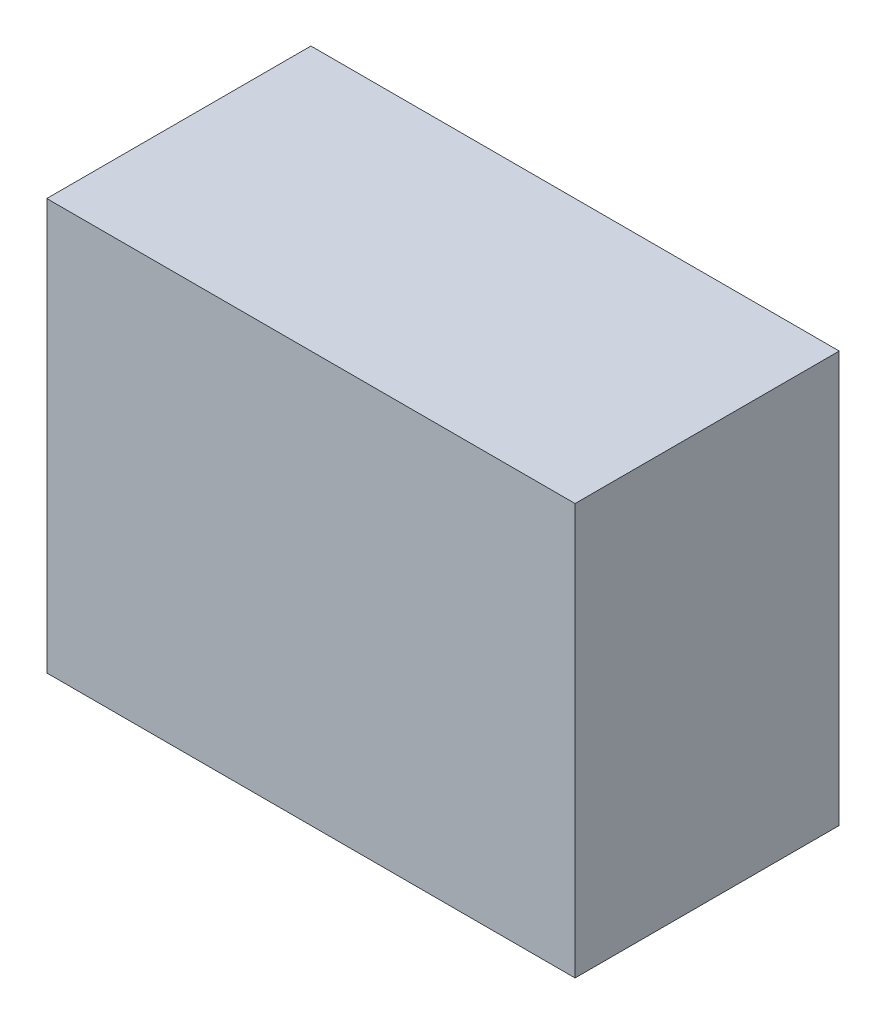
ISO-10303-21;
HEADER;
FILE_DESCRIPTION(('STEP AP214'),'2;1');
FILE_NAME('part.step','',(''),(''),'','','');
FILE_SCHEMA(('AUTOMOTIVE_DESIGN { 1 0 10303 214 1 1 1 1 }'));
ENDSEC;
DATA;
#1=APPLICATION_CONTEXT('core data for automotive mechanical design processes');
#2=APPLICATION_PROTOCOL_DEFINITION('international standard','automotive_design',2000,#1);
#3=PRODUCT_CONTEXT('',#1,'mechanical');
#4=PRODUCT('Part','Part','',(#3));
#5=PRODUCT_RELATED_PRODUCT_CATEGORY('part','',(#4));
#6=PRODUCT_DEFINITION_FORMATION('','',#4);
#7=PRODUCT_DEFINITION_CONTEXT('part definition',#1,'design');
#8=PRODUCT_DEFINITION('design','',#6,#7);
#9=PRODUCT_DEFINITION_SHAPE('','',#8);
#10=(LENGTH_UNIT() NAMED_UNIT(*) SI_UNIT(.MILLI.,.METRE.));
#11=(NAMED_UNIT(*) PLANE_ANGLE_UNIT() SI_UNIT($,.RADIAN.));
#12=(NAMED_UNIT(*) SI_UNIT($,.STERADIAN.) SOLID_ANGLE_UNIT());
#13=UNCERTAINTY_MEASURE_WITH_UNIT(LENGTH_MEASURE(1.E-05),#10,'distance_accuracy_value','');
#14=(GEOMETRIC_REPRESENTATION_CONTEXT(3) GLOBAL_UNCERTAINTY_ASSIGNED_CONTEXT((#13)) GLOBAL_UNIT_ASSIGNED_CONTEXT((#10,
#11,#12)) REPRESENTATION_CONTEXT('',''));
#15=CARTESIAN_POINT('',(0.,0.,0.));
#16=DIRECTION('',(0.,0.,1.));
#17=DIRECTION('',(1.,0.,0.));
#18=AXIS2_PLACEMENT_3D('',#15,#16,#17);
#19=CARTESIAN_POINT('',(1.80000148,1.39999974,1.79999894));
#20=DIRECTION('',(0.,0.,1.));
#21=DIRECTION('',(1.,0.,0.));
#22=AXIS2_PLACEMENT_3D('',#19,#20,#21);
#23=PLANE('',#22);
#24=DIRECTION('',(1.,0.,0.));
#25=VECTOR('',#24,1.);
#26=CARTESIAN_POINT('',(1.80000148,-1.39999974,1.79999894));
#27=LINE('',#26,#25);
#28=CARTESIAN_POINT('',(1.80000148,-1.39999974,1.79999894));
#29=VERTEX_POINT('',#28);
#30=CARTESIAN_POINT('',(-1.79999894,-1.39999974,1.79999894));
#31=VERTEX_POINT('',#30);
#32=EDGE_CURVE('E53',#29,#31,#27,.F.);
#33=ORIENTED_EDGE('',*,*,#32,.F.);
#34=DIRECTION('',(0.,1.,0.));
#35=VECTOR('',#34,1.);
#36=CARTESIAN_POINT('',(1.80000148,1.39999974,1.79999894));
#37=LINE('',#36,#35);
#38=CARTESIAN_POINT('',(1.80000148,1.39999974,1.79999894));
#39=VERTEX_POINT('',#38);
#40=EDGE_CURVE('E68',#39,#29,#37,.F.);
#41=ORIENTED_EDGE('',*,*,#40,.F.);
#42=DIRECTION('',(1.,0.,0.));
#43=VECTOR('',#42,1.);
#44=CARTESIAN_POINT('',(-1.79999894,1.39999974,1.79999894));
#45=LINE('',#44,#43);
#46=CARTESIAN_POINT('',(-1.79999894,1.39999974,1.79999894));
#47=VERTEX_POINT('',#46);
#48=EDGE_CURVE('E20',#47,#39,#45,.T.);
#49=ORIENTED_EDGE('',*,*,#48,.F.);
#50=DIRECTION('',(0.,1.,0.));
#51=VECTOR('',#50,1.);
#52=CARTESIAN_POINT('',(-1.79999894,-1.39999974,1.79999894));
#53=LINE('',#52,#51);
#54=EDGE_CURVE('E58',#31,#47,#53,.T.);
#55=ORIENTED_EDGE('',*,*,#54,.F.);
#56=EDGE_LOOP('',(#33,#41,#49,#55));
#57=FACE_BOUND('',#56,.T.);
#58=ADVANCED_FACE('F17',(#57),#23,.T.);
#59=CARTESIAN_POINT('',(-1.79999894,1.39999974,0.));
#60=DIRECTION('',(0.,1.,0.));
#61=DIRECTION('',(0.,0.,1.));
#62=AXIS2_PLACEMENT_3D('',#59,#60,#61);
#63=PLANE('',#62);
#64=DIRECTION('',(0.,0.,-1.));
#65=VECTOR('',#64,1.);
#66=CARTESIAN_POINT('',(1.80000148,1.39999974,0.));
#67=LINE('',#66,#65);
#68=CARTESIAN_POINT('',(1.80000148,1.39999974,0.));
#69=VERTEX_POINT('',#68);
#70=EDGE_CURVE('E79',#69,#39,#67,.F.);
#71=ORIENTED_EDGE('',*,*,#70,.F.);
#72=DIRECTION('',(1.,0.,0.));
#73=VECTOR('',#72,1.);
#74=CARTESIAN_POINT('',(1.80000148,1.39999974,0.));
#75=LINE('',#74,#73);
#76=CARTESIAN_POINT('',(-1.79999894,1.39999974,0.));
#77=VERTEX_POINT('',#76);
#78=EDGE_CURVE('E74',#69,#77,#75,.F.);
#79=ORIENTED_EDGE('',*,*,#78,.T.);
#80=DIRECTION('',(0.,0.,1.));
#81=VECTOR('',#80,1.);
#82=CARTESIAN_POINT('',(-1.79999894,1.39999974,0.));
#83=LINE('',#82,#81);
#84=EDGE_CURVE('E63',#47,#77,#83,.F.);
#85=ORIENTED_EDGE('',*,*,#84,.F.);
#86=ORIENTED_EDGE('',*,*,#48,.T.);
#87=EDGE_LOOP('',(#71,#79,#85,#86));
#88=FACE_BOUND('',#87,.T.);
#89=ADVANCED_FACE('F73',(#88),#63,.T.);
#90=CARTESIAN_POINT('',(-1.79999894,-1.39999974,0.));
#91=DIRECTION('',(-1.,0.,0.));
#92=DIRECTION('',(0.,0.,1.));
#93=AXIS2_PLACEMENT_3D('',#90,#91,#92);
#94=PLANE('',#93);
#95=ORIENTED_EDGE('',*,*,#84,.T.);
#96=DIRECTION('',(0.,1.,0.));
#97=VECTOR('',#96,1.);
#98=CARTESIAN_POINT('',(-1.79999894,1.39999974,0.));
#99=LINE('',#98,#97);
#100=CARTESIAN_POINT('',(-1.79999894,-1.39999974,0.));
#101=VERTEX_POINT('',#100);
#102=EDGE_CURVE('E84',#77,#101,#99,.F.);
#103=ORIENTED_EDGE('',*,*,#102,.T.);
#104=DIRECTION('',(0.,0.,-1.));
#105=VECTOR('',#104,1.);
#106=CARTESIAN_POINT('',(-1.79999894,-1.39999974,0.));
#107=LINE('',#106,#105);
#108=EDGE_CURVE('E65',#31,#101,#107,.T.);
#109=ORIENTED_EDGE('',*,*,#108,.F.);
#110=ORIENTED_EDGE('',*,*,#54,.T.);
#111=EDGE_LOOP('',(#95,#103,#109,#110));
#112=FACE_BOUND('',#111,.T.);
#113=ADVANCED_FACE('F60',(#112),#94,.T.);
#114=CARTESIAN_POINT('',(1.80000148,-1.39999974,0.));
#115=DIRECTION('',(0.,-1.,0.));
#116=DIRECTION('',(0.,0.,-1.));
#117=AXIS2_PLACEMENT_3D('',#114,#115,#116);
#118=PLANE('',#117);
#119=ORIENTED_EDGE('',*,*,#108,.T.);
#120=DIRECTION('',(1.,0.,0.));
#121=VECTOR('',#120,1.);
#122=CARTESIAN_POINT('',(1.80000148,-1.39999974,0.));
#123=LINE('',#122,#121);
#124=CARTESIAN_POINT('',(1.80000148,-1.39999974,0.));
#125=VERTEX_POINT('',#124);
#126=EDGE_CURVE('E26',#101,#125,#123,.T.);
#127=ORIENTED_EDGE('',*,*,#126,.T.);
#128=DIRECTION('',(0.,0.,-1.));
#129=VECTOR('',#128,1.);
#130=CARTESIAN_POINT('',(1.80000148,-1.39999974,0.));
#131=LINE('',#130,#129);
#132=EDGE_CURVE('E34',#29,#125,#131,.T.);
#133=ORIENTED_EDGE('',*,*,#132,.F.);
#134=ORIENTED_EDGE('',*,*,#32,.T.);
#135=EDGE_LOOP('',(#119,#127,#133,#134));
#136=FACE_BOUND('',#135,.T.);
#137=ADVANCED_FACE('F88',(#136),#118,.T.);
#138=CARTESIAN_POINT('',(1.80000148,1.39999974,0.));
#139=DIRECTION('',(1.,0.,0.));
#140=DIRECTION('',(0.,0.,-1.));
#141=AXIS2_PLACEMENT_3D('',#138,#139,#140);
#142=PLANE('',#141);
#143=ORIENTED_EDGE('',*,*,#132,.T.);
#144=DIRECTION('',(0.,1.,0.));
#145=VECTOR('',#144,1.);
#146=CARTESIAN_POINT('',(1.80000148,1.39999974,0.));
#147=LINE('',#146,#145);
#148=EDGE_CURVE('E11',#125,#69,#147,.T.);
#149=ORIENTED_EDGE('',*,*,#148,.T.);
#150=ORIENTED_EDGE('',*,*,#70,.T.);
#151=ORIENTED_EDGE('',*,*,#40,.T.);
#152=EDGE_LOOP('',(#143,#149,#150,#151));
#153=FACE_BOUND('',#152,.T.);
#154=ADVANCED_FACE('F91',(#153),#142,.T.);
#155=CARTESIAN_POINT('',(1.80000148,1.39999974,0.));
#156=DIRECTION('',(0.,0.,1.));
#157=DIRECTION('',(1.,0.,0.));
#158=AXIS2_PLACEMENT_3D('',#155,#156,#157);
#159=PLANE('',#158);
#160=ORIENTED_EDGE('',*,*,#126,.F.);
#161=ORIENTED_EDGE('',*,*,#102,.F.);
#162=ORIENTED_EDGE('',*,*,#78,.F.);
#163=ORIENTED_EDGE('',*,*,#148,.F.);
#164=EDGE_LOOP('',(#160,#161,#162,#163));
#165=FACE_BOUND('',#164,.T.);
#166=ADVANCED_FACE('F90',(#165),#159,.F.);
#167=CLOSED_SHELL('',(#58,#89,#113,#137,#154,#166));
#168=MANIFOLD_SOLID_BREP('B1',#167);
#169=ADVANCED_BREP_SHAPE_REPRESENTATION('',(#18,#168),#14);
#170=SHAPE_DEFINITION_REPRESENTATION(#9,#169);
ENDSEC;
END-ISO-10303-21;
